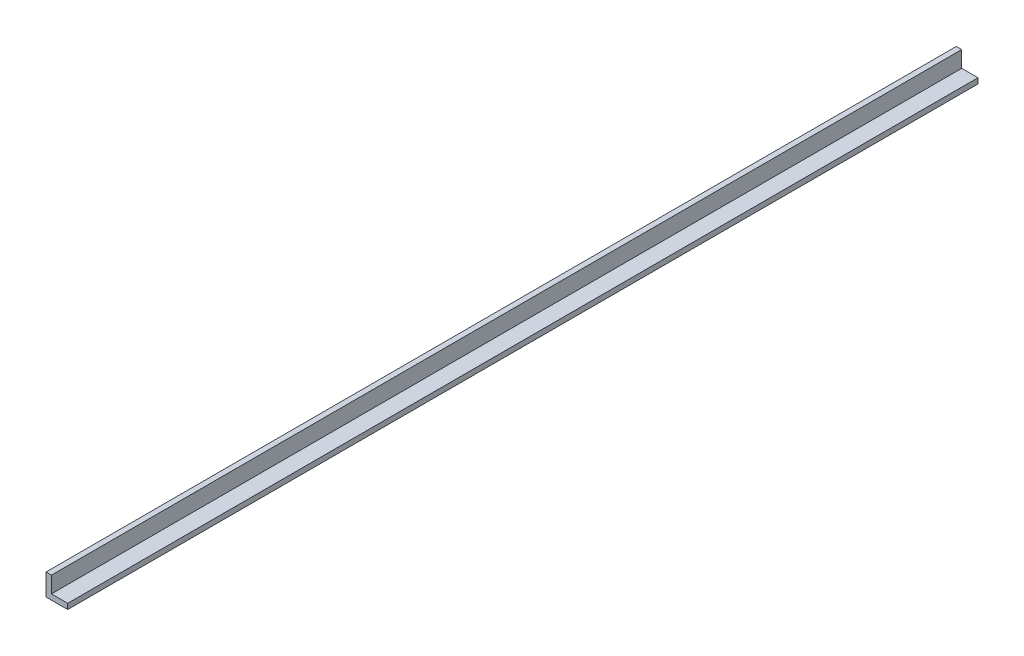
ISO-10303-21;
HEADER;
FILE_DESCRIPTION(('STEP AP214'),'2;1');
FILE_NAME('part.step','',(''),(''),'','','');
FILE_SCHEMA(('AUTOMOTIVE_DESIGN { 1 0 10303 214 1 1 1 1 }'));
ENDSEC;
DATA;
#1=APPLICATION_CONTEXT('core data for automotive mechanical design processes');
#2=APPLICATION_PROTOCOL_DEFINITION('international standard','automotive_design',2000,#1);
#3=PRODUCT_CONTEXT('',#1,'mechanical');
#4=PRODUCT('Part','Part','',(#3));
#5=PRODUCT_RELATED_PRODUCT_CATEGORY('part','',(#4));
#6=PRODUCT_DEFINITION_FORMATION('','',#4);
#7=PRODUCT_DEFINITION_CONTEXT('part definition',#1,'design');
#8=PRODUCT_DEFINITION('design','',#6,#7);
#9=PRODUCT_DEFINITION_SHAPE('','',#8);
#10=(LENGTH_UNIT() NAMED_UNIT(*) SI_UNIT(.MILLI.,.METRE.));
#11=(NAMED_UNIT(*) PLANE_ANGLE_UNIT() SI_UNIT($,.RADIAN.));
#12=(NAMED_UNIT(*) SI_UNIT($,.STERADIAN.) SOLID_ANGLE_UNIT());
#13=UNCERTAINTY_MEASURE_WITH_UNIT(LENGTH_MEASURE(1.E-05),#10,'distance_accuracy_value','');
#14=(GEOMETRIC_REPRESENTATION_CONTEXT(3) GLOBAL_UNCERTAINTY_ASSIGNED_CONTEXT((#13)) GLOBAL_UNIT_ASSIGNED_CONTEXT((#10,
#11,#12)) REPRESENTATION_CONTEXT('',''));
#15=CARTESIAN_POINT('',(0.,0.,0.));
#16=DIRECTION('',(0.,0.,1.));
#17=DIRECTION('',(1.,0.,0.));
#18=AXIS2_PLACEMENT_3D('',#15,#16,#17);
#19=CARTESIAN_POINT('',(-7.22879464285714,2.49464285714286,0.));
#20=DIRECTION('',(0.,1.,0.));
#21=DIRECTION('',(0.,0.,1.));
#22=AXIS2_PLACEMENT_3D('',#19,#20,#21);
#23=PLANE('',#22);
#24=DIRECTION('',(1.,0.,0.));
#25=VECTOR('',#24,1.);
#26=CARTESIAN_POINT('',(-4.45066964285714,2.49464285714286,1066.8));
#27=LINE('',#26,#25);
#28=CARTESIAN_POINT('',(11.8212053571429,2.49464285714286,1066.8));
#29=VERTEX_POINT('',#28);
#30=CARTESIAN_POINT('',(-7.22879464285714,2.49464285714286,1066.8));
#31=VERTEX_POINT('',#30);
#32=EDGE_CURVE('E72',#29,#31,#27,.F.);
#33=ORIENTED_EDGE('',*,*,#32,.F.);
#34=DIRECTION('',(0.,0.,-1.));
#35=VECTOR('',#34,1.);
#36=CARTESIAN_POINT('',(11.8212053571429,2.49464285714286,0.));
#37=LINE('',#36,#35);
#38=CARTESIAN_POINT('',(11.8212053571429,2.49464285714286,0.));
#39=VERTEX_POINT('',#38);
#40=EDGE_CURVE('E20',#39,#29,#37,.F.);
#41=ORIENTED_EDGE('',*,*,#40,.F.);
#42=DIRECTION('',(1.,0.,0.));
#43=VECTOR('',#42,1.);
#44=CARTESIAN_POINT('',(-4.45066964285714,2.49464285714286,0.));
#45=LINE('',#44,#43);
#46=CARTESIAN_POINT('',(-7.22879464285714,2.49464285714286,0.));
#47=VERTEX_POINT('',#46);
#48=EDGE_CURVE('E67',#39,#47,#45,.F.);
#49=ORIENTED_EDGE('',*,*,#48,.T.);
#50=DIRECTION('',(0.,0.,-1.));
#51=VECTOR('',#50,1.);
#52=CARTESIAN_POINT('',(-7.22879464285714,2.49464285714286,0.));
#53=LINE('',#52,#51);
#54=EDGE_CURVE('E76',#31,#47,#53,.T.);
#55=ORIENTED_EDGE('',*,*,#54,.F.);
#56=EDGE_LOOP('',(#33,#41,#49,#55));
#57=FACE_BOUND('',#56,.T.);
#58=ADVANCED_FACE('F17',(#57),#23,.T.);
#59=CARTESIAN_POINT('',(11.8212053571429,2.49464285714286,0.));
#60=DIRECTION('',(1.,0.,0.));
#61=DIRECTION('',(0.,0.,-1.));
#62=AXIS2_PLACEMENT_3D('',#59,#60,#61);
#63=PLANE('',#62);
#64=DIRECTION('',(0.,1.,0.));
#65=VECTOR('',#64,1.);
#66=CARTESIAN_POINT('',(11.8212053571429,5.27276785714286,1066.8));
#67=LINE('',#66,#65);
#68=CARTESIAN_POINT('',(11.8212053571429,-3.85535714285714,1066.8));
#69=VERTEX_POINT('',#68);
#70=EDGE_CURVE('E103',#69,#29,#67,.T.);
#71=ORIENTED_EDGE('',*,*,#70,.F.);
#72=DIRECTION('',(0.,0.,-1.));
#73=VECTOR('',#72,1.);
#74=CARTESIAN_POINT('',(11.8212053571429,-3.85535714285714,0.));
#75=LINE('',#74,#73);
#76=CARTESIAN_POINT('',(11.8212053571429,-3.85535714285714,0.));
#77=VERTEX_POINT('',#76);
#78=EDGE_CURVE('E80',#77,#69,#75,.F.);
#79=ORIENTED_EDGE('',*,*,#78,.F.);
#80=DIRECTION('',(0.,1.,0.));
#81=VECTOR('',#80,1.);
#82=CARTESIAN_POINT('',(11.8212053571429,5.27276785714286,0.));
#83=LINE('',#82,#81);
#84=EDGE_CURVE('E78',#77,#39,#83,.T.);
#85=ORIENTED_EDGE('',*,*,#84,.T.);
#86=ORIENTED_EDGE('',*,*,#40,.T.);
#87=EDGE_LOOP('',(#71,#79,#85,#86));
#88=FACE_BOUND('',#87,.T.);
#89=ADVANCED_FACE('F79',(#88),#63,.T.);
#90=CARTESIAN_POINT('',(-7.22879464285714,21.5446428571429,0.));
#91=DIRECTION('',(1.,0.,0.));
#92=DIRECTION('',(0.,0.,-1.));
#93=AXIS2_PLACEMENT_3D('',#90,#91,#92);
#94=PLANE('',#93);
#95=DIRECTION('',(0.,1.,0.));
#96=VECTOR('',#95,1.);
#97=CARTESIAN_POINT('',(-7.22879464285714,5.27276785714286,1066.8));
#98=LINE('',#97,#96);
#99=CARTESIAN_POINT('',(-7.22879464285714,21.5446428571429,1066.8));
#100=VERTEX_POINT('',#99);
#101=EDGE_CURVE('E96',#31,#100,#98,.T.);
#102=ORIENTED_EDGE('',*,*,#101,.F.);
#103=ORIENTED_EDGE('',*,*,#54,.T.);
#104=DIRECTION('',(0.,1.,0.));
#105=VECTOR('',#104,1.);
#106=CARTESIAN_POINT('',(-7.22879464285714,5.27276785714286,0.));
#107=LINE('',#106,#105);
#108=CARTESIAN_POINT('',(-7.22879464285714,21.5446428571429,0.));
#109=VERTEX_POINT('',#108);
#110=EDGE_CURVE('E87',#47,#109,#107,.T.);
#111=ORIENTED_EDGE('',*,*,#110,.T.);
#112=DIRECTION('',(0.,0.,1.));
#113=VECTOR('',#112,1.);
#114=CARTESIAN_POINT('',(-7.22879464285714,21.5446428571429,0.));
#115=LINE('',#114,#113);
#116=EDGE_CURVE('E98',#100,#109,#115,.F.);
#117=ORIENTED_EDGE('',*,*,#116,.F.);
#118=EDGE_LOOP('',(#102,#103,#111,#117));
#119=FACE_BOUND('',#118,.T.);
#120=ADVANCED_FACE('F94',(#119),#94,.T.);
#121=CARTESIAN_POINT('',(-4.45066964285714,5.27276785714286,0.));
#122=DIRECTION('',(0.,0.,1.));
#123=DIRECTION('',(1.,0.,0.));
#124=AXIS2_PLACEMENT_3D('',#121,#122,#123);
#125=PLANE('',#124);
#126=ORIENTED_EDGE('',*,*,#110,.F.);
#127=ORIENTED_EDGE('',*,*,#48,.F.);
#128=ORIENTED_EDGE('',*,*,#84,.F.);
#129=DIRECTION('',(1.,0.,0.));
#130=VECTOR('',#129,1.);
#131=CARTESIAN_POINT('',(11.8212053571429,-3.85535714285714,0.));
#132=LINE('',#131,#130);
#133=CARTESIAN_POINT('',(-13.5787946428571,-3.85535714285714,0.));
#134=VERTEX_POINT('',#133);
#135=EDGE_CURVE('E89',#134,#77,#132,.T.);
#136=ORIENTED_EDGE('',*,*,#135,.F.);
#137=DIRECTION('',(0.,1.,0.));
#138=VECTOR('',#137,1.);
#139=CARTESIAN_POINT('',(-13.5787946428571,-3.85535714285714,0.));
#140=LINE('',#139,#138);
#141=CARTESIAN_POINT('',(-13.5787946428571,21.5446428571429,0.));
#142=VERTEX_POINT('',#141);
#143=EDGE_CURVE('E113',#142,#134,#140,.F.);
#144=ORIENTED_EDGE('',*,*,#143,.F.);
#145=DIRECTION('',(1.,0.,0.));
#146=VECTOR('',#145,1.);
#147=CARTESIAN_POINT('',(-13.5787946428571,21.5446428571429,0.));
#148=LINE('',#147,#146);
#149=EDGE_CURVE('E115',#109,#142,#148,.F.);
#150=ORIENTED_EDGE('',*,*,#149,.F.);
#151=EDGE_LOOP('',(#126,#127,#128,#136,#144,#150));
#152=FACE_BOUND('',#151,.T.);
#153=ADVANCED_FACE('F85',(#152),#125,.F.);
#154=CARTESIAN_POINT('',(11.8212053571429,-3.85535714285714,0.));
#155=DIRECTION('',(0.,-1.,0.));
#156=DIRECTION('',(0.,0.,-1.));
#157=AXIS2_PLACEMENT_3D('',#154,#155,#156);
#158=PLANE('',#157);
#159=DIRECTION('',(1.,0.,0.));
#160=VECTOR('',#159,1.);
#161=CARTESIAN_POINT('',(-4.45066964285714,-3.85535714285714,1066.8));
#162=LINE('',#161,#160);
#163=CARTESIAN_POINT('',(-13.5787946428571,-3.85535714285714,1066.8));
#164=VERTEX_POINT('',#163);
#165=EDGE_CURVE('E99',#164,#69,#162,.T.);
#166=ORIENTED_EDGE('',*,*,#165,.F.);
#167=DIRECTION('',(0.,0.,1.));
#168=VECTOR('',#167,1.);
#169=CARTESIAN_POINT('',(-13.5787946428571,-3.85535714285714,0.));
#170=LINE('',#169,#168);
#171=EDGE_CURVE('E111',#134,#164,#170,.T.);
#172=ORIENTED_EDGE('',*,*,#171,.F.);
#173=ORIENTED_EDGE('',*,*,#135,.T.);
#174=ORIENTED_EDGE('',*,*,#78,.T.);
#175=EDGE_LOOP('',(#166,#172,#173,#174));
#176=FACE_BOUND('',#175,.T.);
#177=ADVANCED_FACE('F109',(#176),#158,.T.);
#178=CARTESIAN_POINT('',(-4.45066964285714,5.27276785714286,1066.8));
#179=DIRECTION('',(0.,0.,1.));
#180=DIRECTION('',(1.,0.,0.));
#181=AXIS2_PLACEMENT_3D('',#178,#179,#180);
#182=PLANE('',#181);
#183=ORIENTED_EDGE('',*,*,#165,.T.);
#184=ORIENTED_EDGE('',*,*,#70,.T.);
#185=ORIENTED_EDGE('',*,*,#32,.T.);
#186=ORIENTED_EDGE('',*,*,#101,.T.);
#187=DIRECTION('',(1.,0.,0.));
#188=VECTOR('',#187,1.);
#189=CARTESIAN_POINT('',(-13.5787946428571,21.5446428571429,1066.8));
#190=LINE('',#189,#188);
#191=CARTESIAN_POINT('',(-13.5787946428571,21.5446428571429,1066.8));
#192=VERTEX_POINT('',#191);
#193=EDGE_CURVE('E35',#192,#100,#190,.T.);
#194=ORIENTED_EDGE('',*,*,#193,.F.);
#195=DIRECTION('',(0.,1.,0.));
#196=VECTOR('',#195,1.);
#197=CARTESIAN_POINT('',(-13.5787946428571,-3.85535714285714,1066.8));
#198=LINE('',#197,#196);
#199=EDGE_CURVE('E26',#164,#192,#198,.T.);
#200=ORIENTED_EDGE('',*,*,#199,.F.);
#201=EDGE_LOOP('',(#183,#184,#185,#186,#194,#200));
#202=FACE_BOUND('',#201,.T.);
#203=ADVANCED_FACE('F102',(#202),#182,.T.);
#204=CARTESIAN_POINT('',(-13.5787946428571,21.5446428571429,0.));
#205=DIRECTION('',(0.,1.,0.));
#206=DIRECTION('',(0.,0.,1.));
#207=AXIS2_PLACEMENT_3D('',#204,#205,#206);
#208=PLANE('',#207);
#209=ORIENTED_EDGE('',*,*,#193,.T.);
#210=ORIENTED_EDGE('',*,*,#116,.T.);
#211=ORIENTED_EDGE('',*,*,#149,.T.);
#212=DIRECTION('',(0.,0.,1.));
#213=VECTOR('',#212,1.);
#214=CARTESIAN_POINT('',(-13.5787946428571,21.5446428571429,0.));
#215=LINE('',#214,#213);
#216=EDGE_CURVE('E11',#192,#142,#215,.F.);
#217=ORIENTED_EDGE('',*,*,#216,.F.);
#218=EDGE_LOOP('',(#209,#210,#211,#217));
#219=FACE_BOUND('',#218,.T.);
#220=ADVANCED_FACE('F119',(#219),#208,.T.);
#221=CARTESIAN_POINT('',(-13.5787946428571,-3.85535714285714,0.));
#222=DIRECTION('',(-1.,0.,0.));
#223=DIRECTION('',(0.,0.,1.));
#224=AXIS2_PLACEMENT_3D('',#221,#222,#223);
#225=PLANE('',#224);
#226=ORIENTED_EDGE('',*,*,#199,.T.);
#227=ORIENTED_EDGE('',*,*,#216,.T.);
#228=ORIENTED_EDGE('',*,*,#143,.T.);
#229=ORIENTED_EDGE('',*,*,#171,.T.);
#230=EDGE_LOOP('',(#226,#227,#228,#229));
#231=FACE_BOUND('',#230,.T.);
#232=ADVANCED_FACE('F122',(#231),#225,.T.);
#233=CLOSED_SHELL('',(#58,#89,#120,#153,#177,#203,#220,#232));
#234=MANIFOLD_SOLID_BREP('B1',#233);
#235=ADVANCED_BREP_SHAPE_REPRESENTATION('',(#18,#234),#14);
#236=SHAPE_DEFINITION_REPRESENTATION(#9,#235);
ENDSEC;
END-ISO-10303-21;
